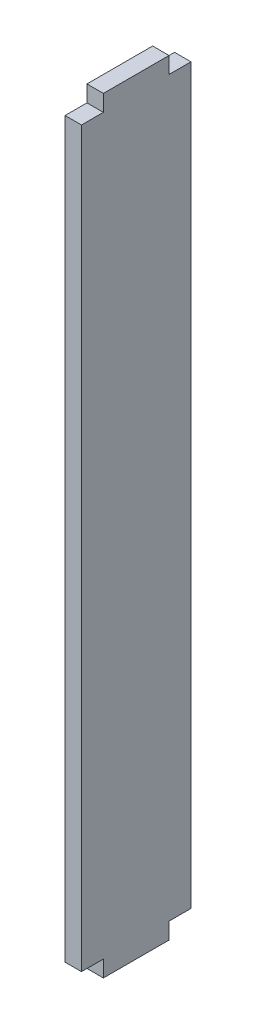
ISO-10303-21;
HEADER;
FILE_DESCRIPTION(('STEP AP214'),'2;1');
FILE_NAME('part.step','',(''),(''),'','','');
FILE_SCHEMA(('AUTOMOTIVE_DESIGN { 1 0 10303 214 1 1 1 1 }'));
ENDSEC;
DATA;
#1=APPLICATION_CONTEXT('core data for automotive mechanical design processes');
#2=APPLICATION_PROTOCOL_DEFINITION('international standard','automotive_design',2000,#1);
#3=PRODUCT_CONTEXT('',#1,'mechanical');
#4=PRODUCT('Part','Part','',(#3));
#5=PRODUCT_RELATED_PRODUCT_CATEGORY('part','',(#4));
#6=PRODUCT_DEFINITION_FORMATION('','',#4);
#7=PRODUCT_DEFINITION_CONTEXT('part definition',#1,'design');
#8=PRODUCT_DEFINITION('design','',#6,#7);
#9=PRODUCT_DEFINITION_SHAPE('','',#8);
#10=(LENGTH_UNIT() NAMED_UNIT(*) SI_UNIT(.MILLI.,.METRE.));
#11=(NAMED_UNIT(*) PLANE_ANGLE_UNIT() SI_UNIT($,.RADIAN.));
#12=(NAMED_UNIT(*) SI_UNIT($,.STERADIAN.) SOLID_ANGLE_UNIT());
#13=UNCERTAINTY_MEASURE_WITH_UNIT(LENGTH_MEASURE(1.E-05),#10,'distance_accuracy_value','');
#14=(GEOMETRIC_REPRESENTATION_CONTEXT(3) GLOBAL_UNCERTAINTY_ASSIGNED_CONTEXT((#13)) GLOBAL_UNIT_ASSIGNED_CONTEXT((#10,
#11,#12)) REPRESENTATION_CONTEXT('',''));
#15=CARTESIAN_POINT('',(0.,0.,0.));
#16=DIRECTION('',(0.,0.,1.));
#17=DIRECTION('',(1.,0.,0.));
#18=AXIS2_PLACEMENT_3D('',#15,#16,#17);
#19=CARTESIAN_POINT('',(1.5,-30.8441558441559,10.));
#20=DIRECTION('',(0.,0.,-1.));
#21=DIRECTION('',(-1.,0.,0.));
#22=AXIS2_PLACEMENT_3D('',#19,#20,#21);
#23=PLANE('',#22);
#24=DIRECTION('',(0.,-1.,0.));
#25=VECTOR('',#24,1.);
#26=CARTESIAN_POINT('',(0.,-30.8441558441559,10.));
#27=LINE('',#26,#25);
#28=CARTESIAN_POINT('',(0.,37.6558441558441,10.));
#29=VERTEX_POINT('',#28);
#30=CARTESIAN_POINT('',(0.,-29.3441558441559,10.));
#31=VERTEX_POINT('',#30);
#32=EDGE_CURVE('E181',#29,#31,#27,.T.);
#33=ORIENTED_EDGE('',*,*,#32,.T.);
#34=DIRECTION('',(1.,0.,0.));
#35=VECTOR('',#34,1.);
#36=CARTESIAN_POINT('',(-8.5,-29.3441558441559,10.));
#37=LINE('',#36,#35);
#38=CARTESIAN_POINT('',(1.5,-29.3441558441559,10.));
#39=VERTEX_POINT('',#38);
#40=EDGE_CURVE('E172',#31,#39,#37,.T.);
#41=ORIENTED_EDGE('',*,*,#40,.T.);
#42=DIRECTION('',(0.,-1.,0.));
#43=VECTOR('',#42,1.);
#44=CARTESIAN_POINT('',(1.5,-30.8441558441559,10.));
#45=LINE('',#44,#43);
#46=CARTESIAN_POINT('',(1.5,37.6558441558441,10.));
#47=VERTEX_POINT('',#46);
#48=EDGE_CURVE('E186',#47,#39,#45,.T.);
#49=ORIENTED_EDGE('',*,*,#48,.F.);
#50=DIRECTION('',(1.,0.,0.));
#51=VECTOR('',#50,1.);
#52=CARTESIAN_POINT('',(-8.5,37.6558441558441,10.));
#53=LINE('',#52,#51);
#54=EDGE_CURVE('E182',#29,#47,#53,.T.);
#55=ORIENTED_EDGE('',*,*,#54,.F.);
#56=EDGE_LOOP('',(#33,#41,#49,#55));
#57=FACE_BOUND('',#56,.T.);
#58=ADVANCED_FACE('F36',(#57),#23,.F.);
#59=CARTESIAN_POINT('',(1.5,-30.8441558441559,10.));
#60=DIRECTION('',(0.,1.,0.));
#61=DIRECTION('',(0.,0.,1.));
#62=AXIS2_PLACEMENT_3D('',#59,#60,#61);
#63=PLANE('',#62);
#64=DIRECTION('',(0.,0.,-1.));
#65=VECTOR('',#64,1.);
#66=CARTESIAN_POINT('',(1.5,-30.8441558441559,10.));
#67=LINE('',#66,#65);
#68=CARTESIAN_POINT('',(1.5,-30.8441558441559,8.));
#69=VERTEX_POINT('',#68);
#70=CARTESIAN_POINT('',(1.5,-30.8441558441559,2.));
#71=VERTEX_POINT('',#70);
#72=EDGE_CURVE('E189',#69,#71,#67,.T.);
#73=ORIENTED_EDGE('',*,*,#72,.F.);
#74=DIRECTION('',(1.,0.,0.));
#75=VECTOR('',#74,1.);
#76=CARTESIAN_POINT('',(-8.5,-30.8441558441559,8.));
#77=LINE('',#76,#75);
#78=CARTESIAN_POINT('',(0.,-30.8441558441559,8.));
#79=VERTEX_POINT('',#78);
#80=EDGE_CURVE('E157',#79,#69,#77,.T.);
#81=ORIENTED_EDGE('',*,*,#80,.F.);
#82=DIRECTION('',(0.,0.,-1.));
#83=VECTOR('',#82,1.);
#84=CARTESIAN_POINT('',(0.,-30.8441558441559,10.));
#85=LINE('',#84,#83);
#86=CARTESIAN_POINT('',(0.,-30.8441558441559,2.));
#87=VERTEX_POINT('',#86);
#88=EDGE_CURVE('E199',#79,#87,#85,.T.);
#89=ORIENTED_EDGE('',*,*,#88,.T.);
#90=DIRECTION('',(1.,0.,0.));
#91=VECTOR('',#90,1.);
#92=CARTESIAN_POINT('',(-8.5,-30.8441558441559,2.));
#93=LINE('',#92,#91);
#94=EDGE_CURVE('E159',#87,#71,#93,.T.);
#95=ORIENTED_EDGE('',*,*,#94,.T.);
#96=EDGE_LOOP('',(#73,#81,#89,#95));
#97=FACE_BOUND('',#96,.T.);
#98=ADVANCED_FACE('F233',(#97),#63,.F.);
#99=CARTESIAN_POINT('',(1.5,-30.8441558441559,0.));
#100=DIRECTION('',(0.,0.,1.));
#101=DIRECTION('',(1.,0.,0.));
#102=AXIS2_PLACEMENT_3D('',#99,#100,#101);
#103=PLANE('',#102);
#104=DIRECTION('',(0.,1.,0.));
#105=VECTOR('',#104,1.);
#106=CARTESIAN_POINT('',(1.5,-30.8441558441559,0.));
#107=LINE('',#106,#105);
#108=CARTESIAN_POINT('',(1.5,-29.3441558441559,0.));
#109=VERTEX_POINT('',#108);
#110=CARTESIAN_POINT('',(1.5,37.6558441558441,0.));
#111=VERTEX_POINT('',#110);
#112=EDGE_CURVE('E148',#109,#111,#107,.T.);
#113=ORIENTED_EDGE('',*,*,#112,.F.);
#114=DIRECTION('',(1.,0.,0.));
#115=VECTOR('',#114,1.);
#116=CARTESIAN_POINT('',(-8.5,-29.3441558441559,0.));
#117=LINE('',#116,#115);
#118=CARTESIAN_POINT('',(0.,-29.3441558441559,0.));
#119=VERTEX_POINT('',#118);
#120=EDGE_CURVE('E161',#119,#109,#117,.T.);
#121=ORIENTED_EDGE('',*,*,#120,.F.);
#122=DIRECTION('',(0.,1.,0.));
#123=VECTOR('',#122,1.);
#124=CARTESIAN_POINT('',(0.,-30.8441558441559,0.));
#125=LINE('',#124,#123);
#126=CARTESIAN_POINT('',(0.,37.6558441558441,0.));
#127=VERTEX_POINT('',#126);
#128=EDGE_CURVE('E202',#119,#127,#125,.T.);
#129=ORIENTED_EDGE('',*,*,#128,.T.);
#130=DIRECTION('',(1.,0.,0.));
#131=VECTOR('',#130,1.);
#132=CARTESIAN_POINT('',(-8.5,37.6558441558441,0.));
#133=LINE('',#132,#131);
#134=EDGE_CURVE('E132',#127,#111,#133,.T.);
#135=ORIENTED_EDGE('',*,*,#134,.T.);
#136=EDGE_LOOP('',(#113,#121,#129,#135));
#137=FACE_BOUND('',#136,.T.);
#138=ADVANCED_FACE('F251',(#137),#103,.F.);
#139=CARTESIAN_POINT('',(1.5,39.1558441558441,10.));
#140=DIRECTION('',(0.,-1.,0.));
#141=DIRECTION('',(0.,0.,-1.));
#142=AXIS2_PLACEMENT_3D('',#139,#140,#141);
#143=PLANE('',#142);
#144=DIRECTION('',(0.,0.,1.));
#145=VECTOR('',#144,1.);
#146=CARTESIAN_POINT('',(1.5,39.1558441558441,10.));
#147=LINE('',#146,#145);
#148=CARTESIAN_POINT('',(1.5,39.1558441558441,2.));
#149=VERTEX_POINT('',#148);
#150=CARTESIAN_POINT('',(1.5,39.1558441558441,8.));
#151=VERTEX_POINT('',#150);
#152=EDGE_CURVE('E194',#149,#151,#147,.T.);
#153=ORIENTED_EDGE('',*,*,#152,.F.);
#154=DIRECTION('',(1.,0.,0.));
#155=VECTOR('',#154,1.);
#156=CARTESIAN_POINT('',(-8.5,39.1558441558441,2.));
#157=LINE('',#156,#155);
#158=CARTESIAN_POINT('',(0.,39.1558441558441,2.));
#159=VERTEX_POINT('',#158);
#160=EDGE_CURVE('E138',#159,#149,#157,.T.);
#161=ORIENTED_EDGE('',*,*,#160,.F.);
#162=DIRECTION('',(0.,0.,1.));
#163=VECTOR('',#162,1.);
#164=CARTESIAN_POINT('',(0.,39.1558441558441,10.));
#165=LINE('',#164,#163);
#166=CARTESIAN_POINT('',(0.,39.1558441558441,8.));
#167=VERTEX_POINT('',#166);
#168=EDGE_CURVE('E190',#159,#167,#165,.T.);
#169=ORIENTED_EDGE('',*,*,#168,.T.);
#170=DIRECTION('',(1.,0.,0.));
#171=VECTOR('',#170,1.);
#172=CARTESIAN_POINT('',(-8.5,39.1558441558441,8.));
#173=LINE('',#172,#171);
#174=EDGE_CURVE('E179',#167,#151,#173,.T.);
#175=ORIENTED_EDGE('',*,*,#174,.T.);
#176=EDGE_LOOP('',(#153,#161,#169,#175));
#177=FACE_BOUND('',#176,.T.);
#178=ADVANCED_FACE('F247',(#177),#143,.F.);
#179=CARTESIAN_POINT('',(1.5,0.,0.));
#180=DIRECTION('',(-1.,0.,0.));
#181=DIRECTION('',(0.,0.,1.));
#182=AXIS2_PLACEMENT_3D('',#179,#180,#181);
#183=PLANE('',#182);
#184=DIRECTION('',(0.,0.,1.));
#185=VECTOR('',#184,1.);
#186=CARTESIAN_POINT('',(1.5,-29.3441558441559,8.));
#187=LINE('',#186,#185);
#188=CARTESIAN_POINT('',(1.5,-29.3441558441559,8.));
#189=VERTEX_POINT('',#188);
#190=EDGE_CURVE('E168',#189,#39,#187,.T.);
#191=ORIENTED_EDGE('',*,*,#190,.F.);
#192=DIRECTION('',(0.,1.,0.));
#193=VECTOR('',#192,1.);
#194=CARTESIAN_POINT('',(1.5,-30.8441558441559,8.));
#195=LINE('',#194,#193);
#196=EDGE_CURVE('E165',#69,#189,#195,.T.);
#197=ORIENTED_EDGE('',*,*,#196,.F.);
#198=ORIENTED_EDGE('',*,*,#72,.T.);
#199=DIRECTION('',(0.,-1.,0.));
#200=VECTOR('',#199,1.);
#201=CARTESIAN_POINT('',(1.5,-30.8441558441559,2.));
#202=LINE('',#201,#200);
#203=CARTESIAN_POINT('',(1.5,-29.3441558441559,2.));
#204=VERTEX_POINT('',#203);
#205=EDGE_CURVE('E154',#204,#71,#202,.T.);
#206=ORIENTED_EDGE('',*,*,#205,.F.);
#207=DIRECTION('',(0.,0.,1.));
#208=VECTOR('',#207,1.);
#209=CARTESIAN_POINT('',(1.5,-29.3441558441559,2.));
#210=LINE('',#209,#208);
#211=EDGE_CURVE('E156',#109,#204,#210,.T.);
#212=ORIENTED_EDGE('',*,*,#211,.F.);
#213=ORIENTED_EDGE('',*,*,#112,.T.);
#214=DIRECTION('',(0.,0.,-1.));
#215=VECTOR('',#214,1.);
#216=CARTESIAN_POINT('',(1.5,37.6558441558441,2.));
#217=LINE('',#216,#215);
#218=CARTESIAN_POINT('',(1.5,37.6558441558441,2.));
#219=VERTEX_POINT('',#218);
#220=EDGE_CURVE('E126',#219,#111,#217,.T.);
#221=ORIENTED_EDGE('',*,*,#220,.F.);
#222=DIRECTION('',(0.,-1.,0.));
#223=VECTOR('',#222,1.);
#224=CARTESIAN_POINT('',(1.5,39.1558441558441,2.));
#225=LINE('',#224,#223);
#226=EDGE_CURVE('E135',#149,#219,#225,.T.);
#227=ORIENTED_EDGE('',*,*,#226,.F.);
#228=ORIENTED_EDGE('',*,*,#152,.T.);
#229=DIRECTION('',(0.,1.,0.));
#230=VECTOR('',#229,1.);
#231=CARTESIAN_POINT('',(1.5,39.1558441558441,8.));
#232=LINE('',#231,#230);
#233=CARTESIAN_POINT('',(1.5,37.6558441558441,8.));
#234=VERTEX_POINT('',#233);
#235=EDGE_CURVE('E152',#234,#151,#232,.T.);
#236=ORIENTED_EDGE('',*,*,#235,.F.);
#237=DIRECTION('',(0.,0.,-1.));
#238=VECTOR('',#237,1.);
#239=CARTESIAN_POINT('',(1.5,37.6558441558441,8.));
#240=LINE('',#239,#238);
#241=EDGE_CURVE('E177',#47,#234,#240,.T.);
#242=ORIENTED_EDGE('',*,*,#241,.F.);
#243=ORIENTED_EDGE('',*,*,#48,.T.);
#244=EDGE_LOOP('',(#191,#197,#198,#206,#212,#213,#221,#227,#228,#236,#242,#243));
#245=FACE_BOUND('',#244,.T.);
#246=ADVANCED_FACE('F145',(#245),#183,.F.);
#247=CARTESIAN_POINT('',(0.,0.,0.));
#248=DIRECTION('',(-1.,0.,0.));
#249=DIRECTION('',(0.,0.,1.));
#250=AXIS2_PLACEMENT_3D('',#247,#248,#249);
#251=PLANE('',#250);
#252=DIRECTION('',(0.,-1.,0.));
#253=VECTOR('',#252,1.);
#254=CARTESIAN_POINT('',(0.,0.,8.));
#255=LINE('',#254,#253);
#256=CARTESIAN_POINT('',(0.,-29.3441558441559,8.));
#257=VERTEX_POINT('',#256);
#258=EDGE_CURVE('E11',#257,#79,#255,.T.);
#259=ORIENTED_EDGE('',*,*,#258,.F.);
#260=DIRECTION('',(0.,0.,-1.));
#261=VECTOR('',#260,1.);
#262=CARTESIAN_POINT('',(0.,-29.3441558441559,0.));
#263=LINE('',#262,#261);
#264=EDGE_CURVE('E43',#31,#257,#263,.T.);
#265=ORIENTED_EDGE('',*,*,#264,.F.);
#266=ORIENTED_EDGE('',*,*,#32,.F.);
#267=DIRECTION('',(0.,0.,1.));
#268=VECTOR('',#267,1.);
#269=CARTESIAN_POINT('',(0.,37.6558441558441,0.));
#270=LINE('',#269,#268);
#271=CARTESIAN_POINT('',(0.,37.6558441558441,8.));
#272=VERTEX_POINT('',#271);
#273=EDGE_CURVE('E196',#272,#29,#270,.T.);
#274=ORIENTED_EDGE('',*,*,#273,.F.);
#275=DIRECTION('',(0.,-1.,0.));
#276=VECTOR('',#275,1.);
#277=CARTESIAN_POINT('',(0.,0.,8.));
#278=LINE('',#277,#276);
#279=EDGE_CURVE('E208',#167,#272,#278,.T.);
#280=ORIENTED_EDGE('',*,*,#279,.F.);
#281=ORIENTED_EDGE('',*,*,#168,.F.);
#282=DIRECTION('',(0.,1.,0.));
#283=VECTOR('',#282,1.);
#284=CARTESIAN_POINT('',(0.,0.,2.));
#285=LINE('',#284,#283);
#286=CARTESIAN_POINT('',(0.,37.6558441558441,2.));
#287=VERTEX_POINT('',#286);
#288=EDGE_CURVE('E211',#287,#159,#285,.T.);
#289=ORIENTED_EDGE('',*,*,#288,.F.);
#290=DIRECTION('',(0.,0.,1.));
#291=VECTOR('',#290,1.);
#292=CARTESIAN_POINT('',(0.,37.6558441558441,0.));
#293=LINE('',#292,#291);
#294=EDGE_CURVE('E129',#127,#287,#293,.T.);
#295=ORIENTED_EDGE('',*,*,#294,.F.);
#296=ORIENTED_EDGE('',*,*,#128,.F.);
#297=DIRECTION('',(0.,0.,-1.));
#298=VECTOR('',#297,1.);
#299=CARTESIAN_POINT('',(0.,-29.3441558441559,0.));
#300=LINE('',#299,#298);
#301=CARTESIAN_POINT('',(0.,-29.3441558441559,2.));
#302=VERTEX_POINT('',#301);
#303=EDGE_CURVE('E213',#302,#119,#300,.T.);
#304=ORIENTED_EDGE('',*,*,#303,.F.);
#305=DIRECTION('',(0.,1.,0.));
#306=VECTOR('',#305,1.);
#307=CARTESIAN_POINT('',(0.,0.,2.));
#308=LINE('',#307,#306);
#309=EDGE_CURVE('E215',#87,#302,#308,.T.);
#310=ORIENTED_EDGE('',*,*,#309,.F.);
#311=ORIENTED_EDGE('',*,*,#88,.F.);
#312=EDGE_LOOP('',(#259,#265,#266,#274,#280,#281,#289,#295,#296,#304,#310,#311));
#313=FACE_BOUND('',#312,.T.);
#314=ADVANCED_FACE('F228',(#313),#251,.T.);
#315=CARTESIAN_POINT('',(-8.5,39.1558441558441,8.));
#316=DIRECTION('',(0.,0.,-1.));
#317=DIRECTION('',(-1.,0.,0.));
#318=AXIS2_PLACEMENT_3D('',#315,#316,#317);
#319=PLANE('',#318);
#320=ORIENTED_EDGE('',*,*,#279,.T.);
#321=DIRECTION('',(1.,0.,0.));
#322=VECTOR('',#321,1.);
#323=CARTESIAN_POINT('',(-8.5,37.6558441558441,8.));
#324=LINE('',#323,#322);
#325=EDGE_CURVE('E58',#272,#234,#324,.T.);
#326=ORIENTED_EDGE('',*,*,#325,.T.);
#327=ORIENTED_EDGE('',*,*,#235,.T.);
#328=ORIENTED_EDGE('',*,*,#174,.F.);
#329=EDGE_LOOP('',(#320,#326,#327,#328));
#330=FACE_BOUND('',#329,.T.);
#331=ADVANCED_FACE('F245',(#330),#319,.F.);
#332=CARTESIAN_POINT('',(-8.5,37.6558441558441,8.));
#333=DIRECTION('',(0.,-1.,0.));
#334=DIRECTION('',(0.,0.,-1.));
#335=AXIS2_PLACEMENT_3D('',#332,#333,#334);
#336=PLANE('',#335);
#337=ORIENTED_EDGE('',*,*,#273,.T.);
#338=ORIENTED_EDGE('',*,*,#54,.T.);
#339=ORIENTED_EDGE('',*,*,#241,.T.);
#340=ORIENTED_EDGE('',*,*,#325,.F.);
#341=EDGE_LOOP('',(#337,#338,#339,#340));
#342=FACE_BOUND('',#341,.T.);
#343=ADVANCED_FACE('F242',(#342),#336,.F.);
#344=CARTESIAN_POINT('',(-8.5,39.1558441558441,2.));
#345=DIRECTION('',(0.,0.,1.));
#346=DIRECTION('',(1.,0.,0.));
#347=AXIS2_PLACEMENT_3D('',#344,#345,#346);
#348=PLANE('',#347);
#349=ORIENTED_EDGE('',*,*,#288,.T.);
#350=ORIENTED_EDGE('',*,*,#160,.T.);
#351=ORIENTED_EDGE('',*,*,#226,.T.);
#352=DIRECTION('',(1.,0.,0.));
#353=VECTOR('',#352,1.);
#354=CARTESIAN_POINT('',(-8.5,37.6558441558441,2.));
#355=LINE('',#354,#353);
#356=EDGE_CURVE('E122',#287,#219,#355,.T.);
#357=ORIENTED_EDGE('',*,*,#356,.F.);
#358=EDGE_LOOP('',(#349,#350,#351,#357));
#359=FACE_BOUND('',#358,.T.);
#360=ADVANCED_FACE('F136',(#359),#348,.F.);
#361=CARTESIAN_POINT('',(-8.5,37.6558441558441,2.));
#362=DIRECTION('',(0.,-1.,0.));
#363=DIRECTION('',(0.,0.,-1.));
#364=AXIS2_PLACEMENT_3D('',#361,#362,#363);
#365=PLANE('',#364);
#366=ORIENTED_EDGE('',*,*,#294,.T.);
#367=ORIENTED_EDGE('',*,*,#356,.T.);
#368=ORIENTED_EDGE('',*,*,#220,.T.);
#369=ORIENTED_EDGE('',*,*,#134,.F.);
#370=EDGE_LOOP('',(#366,#367,#368,#369));
#371=FACE_BOUND('',#370,.T.);
#372=ADVANCED_FACE('F124',(#371),#365,.F.);
#373=CARTESIAN_POINT('',(-8.5,-30.8441558441559,2.));
#374=DIRECTION('',(0.,0.,1.));
#375=DIRECTION('',(1.,0.,0.));
#376=AXIS2_PLACEMENT_3D('',#373,#374,#375);
#377=PLANE('',#376);
#378=ORIENTED_EDGE('',*,*,#309,.T.);
#379=DIRECTION('',(1.,0.,0.));
#380=VECTOR('',#379,1.);
#381=CARTESIAN_POINT('',(-8.5,-29.3441558441559,2.));
#382=LINE('',#381,#380);
#383=EDGE_CURVE('E50',#302,#204,#382,.T.);
#384=ORIENTED_EDGE('',*,*,#383,.T.);
#385=ORIENTED_EDGE('',*,*,#205,.T.);
#386=ORIENTED_EDGE('',*,*,#94,.F.);
#387=EDGE_LOOP('',(#378,#384,#385,#386));
#388=FACE_BOUND('',#387,.T.);
#389=ADVANCED_FACE('F254',(#388),#377,.F.);
#390=CARTESIAN_POINT('',(-8.5,-29.3441558441559,2.));
#391=DIRECTION('',(0.,1.,0.));
#392=DIRECTION('',(0.,0.,1.));
#393=AXIS2_PLACEMENT_3D('',#390,#391,#392);
#394=PLANE('',#393);
#395=ORIENTED_EDGE('',*,*,#303,.T.);
#396=ORIENTED_EDGE('',*,*,#120,.T.);
#397=ORIENTED_EDGE('',*,*,#211,.T.);
#398=ORIENTED_EDGE('',*,*,#383,.F.);
#399=EDGE_LOOP('',(#395,#396,#397,#398));
#400=FACE_BOUND('',#399,.T.);
#401=ADVANCED_FACE('F252',(#400),#394,.F.);
#402=CARTESIAN_POINT('',(-8.5,-30.8441558441559,8.));
#403=DIRECTION('',(0.,0.,-1.));
#404=DIRECTION('',(-1.,0.,0.));
#405=AXIS2_PLACEMENT_3D('',#402,#403,#404);
#406=PLANE('',#405);
#407=ORIENTED_EDGE('',*,*,#258,.T.);
#408=ORIENTED_EDGE('',*,*,#80,.T.);
#409=ORIENTED_EDGE('',*,*,#196,.T.);
#410=DIRECTION('',(1.,0.,0.));
#411=VECTOR('',#410,1.);
#412=CARTESIAN_POINT('',(-8.5,-29.3441558441559,8.));
#413=LINE('',#412,#411);
#414=EDGE_CURVE('E170',#257,#189,#413,.T.);
#415=ORIENTED_EDGE('',*,*,#414,.F.);
#416=EDGE_LOOP('',(#407,#408,#409,#415));
#417=FACE_BOUND('',#416,.T.);
#418=ADVANCED_FACE('F224',(#417),#406,.F.);
#419=CARTESIAN_POINT('',(-8.5,-29.3441558441559,8.));
#420=DIRECTION('',(0.,1.,0.));
#421=DIRECTION('',(0.,0.,1.));
#422=AXIS2_PLACEMENT_3D('',#419,#420,#421);
#423=PLANE('',#422);
#424=ORIENTED_EDGE('',*,*,#264,.T.);
#425=ORIENTED_EDGE('',*,*,#414,.T.);
#426=ORIENTED_EDGE('',*,*,#190,.T.);
#427=ORIENTED_EDGE('',*,*,#40,.F.);
#428=EDGE_LOOP('',(#424,#425,#426,#427));
#429=FACE_BOUND('',#428,.T.);
#430=ADVANCED_FACE('F219',(#429),#423,.F.);
#431=CLOSED_SHELL('',(#58,#98,#138,#178,#246,#314,#331,#343,#360,#372,#389,#401,#418,#430));
#432=MANIFOLD_SOLID_BREP('B2',#431);
#433=ADVANCED_BREP_SHAPE_REPRESENTATION('',(#18,#432),#14);
#434=SHAPE_DEFINITION_REPRESENTATION(#9,#433);
ENDSEC;
END-ISO-10303-21;
